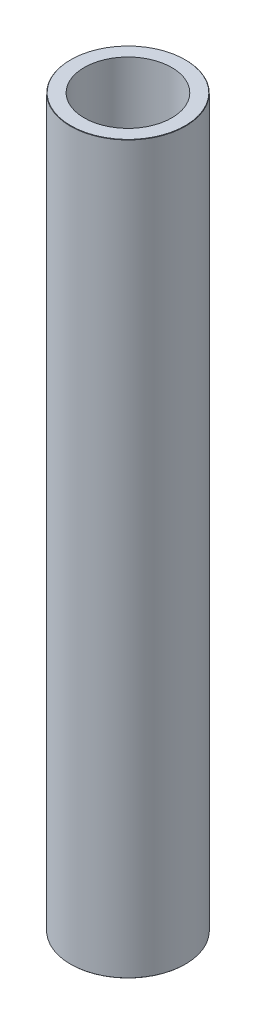
ISO-10303-21;
HEADER;
FILE_DESCRIPTION(('STEP AP214'),'2;1');
FILE_NAME('part.step','',(''),(''),'','','');
FILE_SCHEMA(('AUTOMOTIVE_DESIGN { 1 0 10303 214 1 1 1 1 }'));
ENDSEC;
DATA;
#1=APPLICATION_CONTEXT('core data for automotive mechanical design processes');
#2=APPLICATION_PROTOCOL_DEFINITION('international standard','automotive_design',2000,#1);
#3=PRODUCT_CONTEXT('',#1,'mechanical');
#4=PRODUCT('Part','Part','',(#3));
#5=PRODUCT_RELATED_PRODUCT_CATEGORY('part','',(#4));
#6=PRODUCT_DEFINITION_FORMATION('','',#4);
#7=PRODUCT_DEFINITION_CONTEXT('part definition',#1,'design');
#8=PRODUCT_DEFINITION('design','',#6,#7);
#9=PRODUCT_DEFINITION_SHAPE('','',#8);
#10=(LENGTH_UNIT() NAMED_UNIT(*) SI_UNIT(.MILLI.,.METRE.));
#11=(NAMED_UNIT(*) PLANE_ANGLE_UNIT() SI_UNIT($,.RADIAN.));
#12=(NAMED_UNIT(*) SI_UNIT($,.STERADIAN.) SOLID_ANGLE_UNIT());
#13=UNCERTAINTY_MEASURE_WITH_UNIT(LENGTH_MEASURE(1.E-05),#10,'distance_accuracy_value','');
#14=(GEOMETRIC_REPRESENTATION_CONTEXT(3) GLOBAL_UNCERTAINTY_ASSIGNED_CONTEXT((#13)) GLOBAL_UNIT_ASSIGNED_CONTEXT((#10,
#11,#12)) REPRESENTATION_CONTEXT('',''));
#15=CARTESIAN_POINT('',(0.,0.,0.));
#16=DIRECTION('',(0.,0.,1.));
#17=DIRECTION('',(1.,0.,0.));
#18=AXIS2_PLACEMENT_3D('',#15,#16,#17);
#19=CARTESIAN_POINT('',(0.,600.,0.));
#20=DIRECTION('',(0.,-1.,0.));
#21=DIRECTION('',(0.,0.,-1.));
#22=AXIS2_PLACEMENT_3D('',#19,#20,#21);
#23=CYLINDRICAL_SURFACE('',#22,47.5);
#24=CARTESIAN_POINT('',(0.,599.748938561489,0.));
#25=DIRECTION('',(0.,1.,0.));
#26=DIRECTION('',(0.,0.,1.));
#27=AXIS2_PLACEMENT_3D('',#24,#25,#26);
#28=CIRCLE('',#27,47.5);
#29=CARTESIAN_POINT('',(0.,599.748938561489,47.5));
#30=VERTEX_POINT('',#29);
#31=EDGE_CURVE('E50',#30,#30,#28,.F.);
#32=ORIENTED_EDGE('',*,*,#31,.T.);
#33=EDGE_LOOP('',(#32));
#34=FACE_BOUND('',#33,.T.);
#35=CARTESIAN_POINT('',(0.,0.25106143851128,0.));
#36=DIRECTION('',(0.,1.,0.));
#37=DIRECTION('',(0.,0.,1.));
#38=AXIS2_PLACEMENT_3D('',#35,#36,#37);
#39=CIRCLE('',#38,47.5);
#40=CARTESIAN_POINT('',(0.,0.25106143851128,47.5));
#41=VERTEX_POINT('',#40);
#42=EDGE_CURVE('E51',#41,#41,#39,.T.);
#43=ORIENTED_EDGE('',*,*,#42,.T.);
#44=EDGE_LOOP('',(#43));
#45=FACE_BOUND('',#44,.T.);
#46=ADVANCED_FACE('F39',(#34,#45),#23,.T.);
#47=CARTESIAN_POINT('',(0.,600.,0.));
#48=DIRECTION('',(0.,1.,0.));
#49=DIRECTION('',(0.,0.,1.));
#50=AXIS2_PLACEMENT_3D('',#47,#48,#49);
#51=PLANE('',#50);
#52=CARTESIAN_POINT('',(0.,600.,0.));
#53=DIRECTION('',(0.,1.,0.));
#54=DIRECTION('',(0.,0.,1.));
#55=AXIS2_PLACEMENT_3D('',#52,#53,#54);
#56=CIRCLE('',#55,47.2489385614889);
#57=CARTESIAN_POINT('',(0.,600.,47.2489385614889));
#58=VERTEX_POINT('',#57);
#59=EDGE_CURVE('E54',#58,#58,#56,.T.);
#60=ORIENTED_EDGE('',*,*,#59,.T.);
#61=EDGE_LOOP('',(#60));
#62=FACE_BOUND('',#61,.T.);
#63=CARTESIAN_POINT('',(0.,600.,0.));
#64=DIRECTION('',(0.,1.,0.));
#65=DIRECTION('',(0.,0.,1.));
#66=AXIS2_PLACEMENT_3D('',#63,#64,#65);
#67=CIRCLE('',#66,36.136693345258);
#68=CARTESIAN_POINT('',(0.,600.,36.136693345258));
#69=VERTEX_POINT('',#68);
#70=EDGE_CURVE('E58',#69,#69,#67,.T.);
#71=ORIENTED_EDGE('',*,*,#70,.F.);
#72=EDGE_LOOP('',(#71));
#73=FACE_BOUND('',#72,.T.);
#74=ADVANCED_FACE('F69',(#62,#73),#51,.T.);
#75=CARTESIAN_POINT('',(0.,0.,0.));
#76=DIRECTION('',(0.,1.,0.));
#77=DIRECTION('',(0.,0.,1.));
#78=AXIS2_PLACEMENT_3D('',#75,#76,#77);
#79=PLANE('',#78);
#80=CARTESIAN_POINT('',(0.,0.,0.));
#81=DIRECTION('',(0.,1.,0.));
#82=DIRECTION('',(0.,0.,1.));
#83=AXIS2_PLACEMENT_3D('',#80,#81,#82);
#84=CIRCLE('',#83,47.2489385614888);
#85=CARTESIAN_POINT('',(0.,0.,47.2489385614888));
#86=VERTEX_POINT('',#85);
#87=EDGE_CURVE('E10',#86,#86,#84,.F.);
#88=ORIENTED_EDGE('',*,*,#87,.T.);
#89=EDGE_LOOP('',(#88));
#90=FACE_BOUND('',#89,.T.);
#91=CARTESIAN_POINT('',(0.,0.,0.));
#92=DIRECTION('',(0.,1.,0.));
#93=DIRECTION('',(0.,0.,1.));
#94=AXIS2_PLACEMENT_3D('',#91,#92,#93);
#95=CIRCLE('',#94,36.136693345258);
#96=CARTESIAN_POINT('',(0.,0.,36.136693345258));
#97=VERTEX_POINT('',#96);
#98=EDGE_CURVE('E63',#97,#97,#95,.T.);
#99=ORIENTED_EDGE('',*,*,#98,.T.);
#100=EDGE_LOOP('',(#99));
#101=FACE_BOUND('',#100,.T.);
#102=ADVANCED_FACE('F75',(#90,#101),#79,.F.);
#103=CARTESIAN_POINT('',(0.,600.,0.));
#104=DIRECTION('',(0.,-1.,0.));
#105=DIRECTION('',(0.,0.,-1.));
#106=AXIS2_PLACEMENT_3D('',#103,#104,#105);
#107=CYLINDRICAL_SURFACE('',#106,36.136693345258);
#108=ORIENTED_EDGE('',*,*,#70,.T.);
#109=EDGE_LOOP('',(#108));
#110=FACE_BOUND('',#109,.T.);
#111=ORIENTED_EDGE('',*,*,#98,.F.);
#112=EDGE_LOOP('',(#111));
#113=FACE_BOUND('',#112,.T.);
#114=ADVANCED_FACE('F70',(#110,#113),#107,.F.);
#115=CARTESIAN_POINT('',(0.,600.,0.));
#116=DIRECTION('',(0.,-1.,0.));
#117=DIRECTION('',(0.,0.,-1.));
#118=AXIS2_PLACEMENT_3D('',#115,#116,#117);
#119=CONICAL_SURFACE('',#118,47.2489385614889,0.785398163397614);
#120=ORIENTED_EDGE('',*,*,#31,.F.);
#121=EDGE_LOOP('',(#120));
#122=FACE_BOUND('',#121,.T.);
#123=ORIENTED_EDGE('',*,*,#59,.F.);
#124=EDGE_LOOP('',(#123));
#125=FACE_BOUND('',#124,.T.);
#126=ADVANCED_FACE('F81',(#122,#125),#119,.T.);
#127=CARTESIAN_POINT('',(0.,0.25106143851128,0.));
#128=DIRECTION('',(0.,1.,0.));
#129=DIRECTION('',(0.,0.,1.));
#130=AXIS2_PLACEMENT_3D('',#127,#128,#129);
#131=CONICAL_SURFACE('',#130,47.5,0.785398163397379);
#132=ORIENTED_EDGE('',*,*,#87,.F.);
#133=EDGE_LOOP('',(#132));
#134=FACE_BOUND('',#133,.T.);
#135=ORIENTED_EDGE('',*,*,#42,.F.);
#136=EDGE_LOOP('',(#135));
#137=FACE_BOUND('',#136,.T.);
#138=ADVANCED_FACE('F45',(#134,#137),#131,.T.);
#139=CLOSED_SHELL('',(#46,#74,#102,#114,#126,#138));
#140=MANIFOLD_SOLID_BREP('B2',#139);
#141=ADVANCED_BREP_SHAPE_REPRESENTATION('',(#18,#140),#14);
#142=SHAPE_DEFINITION_REPRESENTATION(#9,#141);
ENDSEC;
END-ISO-10303-21;
